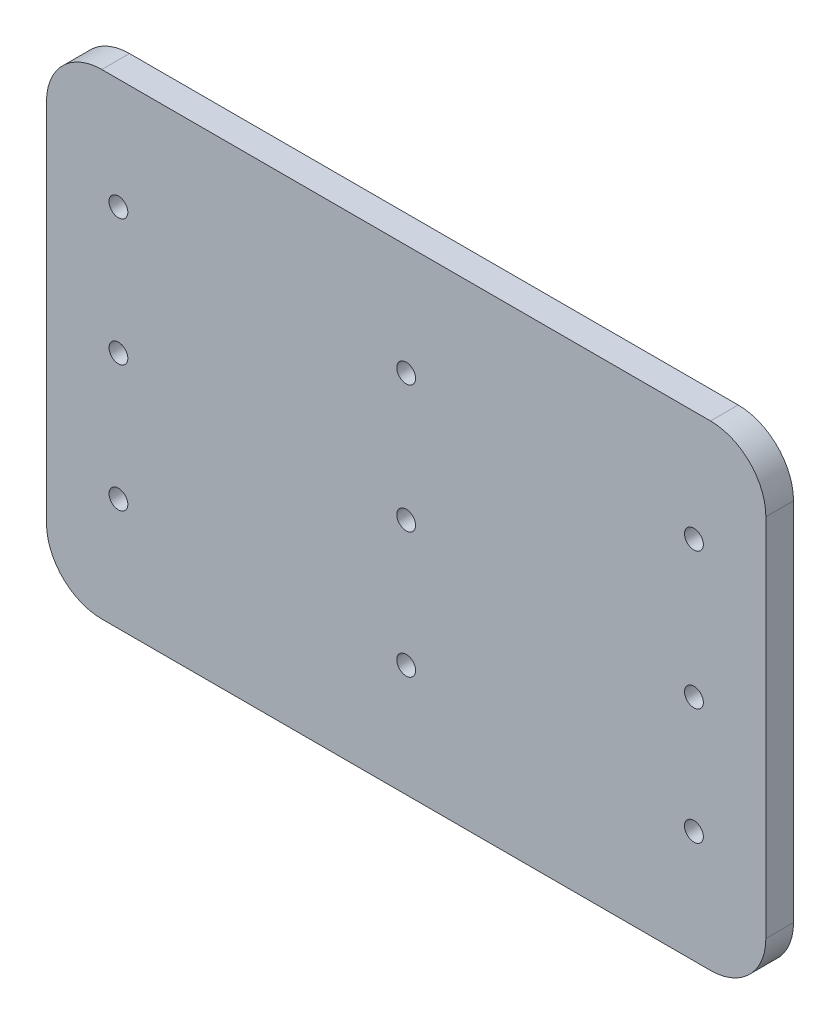
ISO-10303-21;
HEADER;
FILE_DESCRIPTION(('STEP AP214'),'2;1');
FILE_NAME('part.step','',(''),(''),'','','');
FILE_SCHEMA(('AUTOMOTIVE_DESIGN { 1 0 10303 214 1 1 1 1 }'));
ENDSEC;
DATA;
#1=APPLICATION_CONTEXT('core data for automotive mechanical design processes');
#2=APPLICATION_PROTOCOL_DEFINITION('international standard','automotive_design',2000,#1);
#3=PRODUCT_CONTEXT('',#1,'mechanical');
#4=PRODUCT('Part','Part','',(#3));
#5=PRODUCT_RELATED_PRODUCT_CATEGORY('part','',(#4));
#6=PRODUCT_DEFINITION_FORMATION('','',#4);
#7=PRODUCT_DEFINITION_CONTEXT('part definition',#1,'design');
#8=PRODUCT_DEFINITION('design','',#6,#7);
#9=PRODUCT_DEFINITION_SHAPE('','',#8);
#10=(LENGTH_UNIT() NAMED_UNIT(*) SI_UNIT(.MILLI.,.METRE.));
#11=(NAMED_UNIT(*) PLANE_ANGLE_UNIT() SI_UNIT($,.RADIAN.));
#12=(NAMED_UNIT(*) SI_UNIT($,.STERADIAN.) SOLID_ANGLE_UNIT());
#13=UNCERTAINTY_MEASURE_WITH_UNIT(LENGTH_MEASURE(1.E-05),#10,'distance_accuracy_value','');
#14=(GEOMETRIC_REPRESENTATION_CONTEXT(3) GLOBAL_UNCERTAINTY_ASSIGNED_CONTEXT((#13)) GLOBAL_UNIT_ASSIGNED_CONTEXT((#10,
#11,#12)) REPRESENTATION_CONTEXT('',''));
#15=CARTESIAN_POINT('',(0.,0.,0.));
#16=DIRECTION('',(0.,0.,1.));
#17=DIRECTION('',(1.,0.,0.));
#18=AXIS2_PLACEMENT_3D('',#15,#16,#17);
#19=CARTESIAN_POINT('',(-55.,33.,5.));
#20=DIRECTION('',(0.,0.,-1.));
#21=DIRECTION('',(-1.,0.,0.));
#22=AXIS2_PLACEMENT_3D('',#19,#20,#21);
#23=CYLINDRICAL_SURFACE('',#22,9.99999999999999);
#24=CARTESIAN_POINT('',(-55.,33.,0.));
#25=DIRECTION('',(0.,0.,1.));
#26=DIRECTION('',(1.,0.,0.));
#27=AXIS2_PLACEMENT_3D('',#24,#25,#26);
#28=CIRCLE('',#27,9.99999999999999);
#29=CARTESIAN_POINT('',(-65.,32.9999999999999,0.));
#30=VERTEX_POINT('',#29);
#31=CARTESIAN_POINT('',(-54.9999999999999,43.,0.));
#32=VERTEX_POINT('',#31);
#33=EDGE_CURVE('E179',#30,#32,#28,.F.);
#34=ORIENTED_EDGE('',*,*,#33,.F.);
#35=DIRECTION('',(0.,0.,-1.));
#36=VECTOR('',#35,1.);
#37=CARTESIAN_POINT('',(-65.,32.9999999999999,5.));
#38=LINE('',#37,#36);
#39=CARTESIAN_POINT('',(-65.,32.9999999999999,5.));
#40=VERTEX_POINT('',#39);
#41=EDGE_CURVE('E11',#40,#30,#38,.T.);
#42=ORIENTED_EDGE('',*,*,#41,.F.);
#43=CARTESIAN_POINT('',(-55.,33.,5.));
#44=DIRECTION('',(0.,0.,1.));
#45=DIRECTION('',(1.,0.,0.));
#46=AXIS2_PLACEMENT_3D('',#43,#44,#45);
#47=CIRCLE('',#46,9.99999999999999);
#48=CARTESIAN_POINT('',(-54.9999999999999,43.,5.));
#49=VERTEX_POINT('',#48);
#50=EDGE_CURVE('E243',#40,#49,#47,.F.);
#51=ORIENTED_EDGE('',*,*,#50,.T.);
#52=DIRECTION('',(0.,0.,-1.));
#53=VECTOR('',#52,1.);
#54=CARTESIAN_POINT('',(-54.9999999999999,43.,5.));
#55=LINE('',#54,#53);
#56=EDGE_CURVE('E59',#49,#32,#55,.T.);
#57=ORIENTED_EDGE('',*,*,#56,.T.);
#58=EDGE_LOOP('',(#34,#42,#51,#57));
#59=FACE_BOUND('',#58,.T.);
#60=ADVANCED_FACE('F41',(#59),#23,.T.);
#61=CARTESIAN_POINT('',(-65.,0.,5.));
#62=DIRECTION('',(1.,0.,0.));
#63=DIRECTION('',(0.,0.,-1.));
#64=AXIS2_PLACEMENT_3D('',#61,#62,#63);
#65=PLANE('',#64);
#66=DIRECTION('',(0.,-1.,0.));
#67=VECTOR('',#66,1.);
#68=CARTESIAN_POINT('',(-65.,0.,0.));
#69=LINE('',#68,#67);
#70=CARTESIAN_POINT('',(-65.,-32.9999999999999,0.));
#71=VERTEX_POINT('',#70);
#72=EDGE_CURVE('E182',#30,#71,#69,.T.);
#73=ORIENTED_EDGE('',*,*,#72,.T.);
#74=DIRECTION('',(0.,0.,-1.));
#75=VECTOR('',#74,1.);
#76=CARTESIAN_POINT('',(-65.,-32.9999999999999,5.));
#77=LINE('',#76,#75);
#78=CARTESIAN_POINT('',(-65.,-32.9999999999999,5.));
#79=VERTEX_POINT('',#78);
#80=EDGE_CURVE('E51',#79,#71,#77,.T.);
#81=ORIENTED_EDGE('',*,*,#80,.F.);
#82=DIRECTION('',(0.,-1.,0.));
#83=VECTOR('',#82,1.);
#84=CARTESIAN_POINT('',(-65.,0.,5.));
#85=LINE('',#84,#83);
#86=EDGE_CURVE('E239',#40,#79,#85,.T.);
#87=ORIENTED_EDGE('',*,*,#86,.F.);
#88=ORIENTED_EDGE('',*,*,#41,.T.);
#89=EDGE_LOOP('',(#73,#81,#87,#88));
#90=FACE_BOUND('',#89,.T.);
#91=ADVANCED_FACE('F230',(#90),#65,.F.);
#92=CARTESIAN_POINT('',(-55.,-33.,5.));
#93=DIRECTION('',(0.,0.,-1.));
#94=DIRECTION('',(-1.,0.,0.));
#95=AXIS2_PLACEMENT_3D('',#92,#93,#94);
#96=CYLINDRICAL_SURFACE('',#95,10.);
#97=CARTESIAN_POINT('',(-55.,-33.,0.));
#98=DIRECTION('',(0.,0.,1.));
#99=DIRECTION('',(1.,0.,0.));
#100=AXIS2_PLACEMENT_3D('',#97,#98,#99);
#101=CIRCLE('',#100,10.);
#102=CARTESIAN_POINT('',(-54.9999999999999,-43.,0.));
#103=VERTEX_POINT('',#102);
#104=EDGE_CURVE('E186',#103,#71,#101,.F.);
#105=ORIENTED_EDGE('',*,*,#104,.F.);
#106=DIRECTION('',(0.,0.,-1.));
#107=VECTOR('',#106,1.);
#108=CARTESIAN_POINT('',(-54.9999999999999,-43.,5.));
#109=LINE('',#108,#107);
#110=CARTESIAN_POINT('',(-54.9999999999999,-43.,5.));
#111=VERTEX_POINT('',#110);
#112=EDGE_CURVE('E218',#111,#103,#109,.T.);
#113=ORIENTED_EDGE('',*,*,#112,.F.);
#114=CARTESIAN_POINT('',(-55.,-33.,5.));
#115=DIRECTION('',(0.,0.,1.));
#116=DIRECTION('',(1.,0.,0.));
#117=AXIS2_PLACEMENT_3D('',#114,#115,#116);
#118=CIRCLE('',#117,10.);
#119=EDGE_CURVE('E227',#111,#79,#118,.F.);
#120=ORIENTED_EDGE('',*,*,#119,.T.);
#121=ORIENTED_EDGE('',*,*,#80,.T.);
#122=EDGE_LOOP('',(#105,#113,#120,#121));
#123=FACE_BOUND('',#122,.T.);
#124=ADVANCED_FACE('F225',(#123),#96,.T.);
#125=CARTESIAN_POINT('',(0.,-43.,5.));
#126=DIRECTION('',(0.,1.,0.));
#127=DIRECTION('',(0.,0.,1.));
#128=AXIS2_PLACEMENT_3D('',#125,#126,#127);
#129=PLANE('',#128);
#130=DIRECTION('',(1.,0.,0.));
#131=VECTOR('',#130,1.);
#132=CARTESIAN_POINT('',(0.,-43.,0.));
#133=LINE('',#132,#131);
#134=CARTESIAN_POINT('',(54.9999999999999,-43.,0.));
#135=VERTEX_POINT('',#134);
#136=EDGE_CURVE('E190',#103,#135,#133,.T.);
#137=ORIENTED_EDGE('',*,*,#136,.T.);
#138=DIRECTION('',(0.,0.,-1.));
#139=VECTOR('',#138,1.);
#140=CARTESIAN_POINT('',(54.9999999999999,-43.,5.));
#141=LINE('',#140,#139);
#142=CARTESIAN_POINT('',(54.9999999999999,-43.,5.));
#143=VERTEX_POINT('',#142);
#144=EDGE_CURVE('E214',#143,#135,#141,.T.);
#145=ORIENTED_EDGE('',*,*,#144,.F.);
#146=DIRECTION('',(1.,0.,0.));
#147=VECTOR('',#146,1.);
#148=CARTESIAN_POINT('',(0.,-43.,5.));
#149=LINE('',#148,#147);
#150=EDGE_CURVE('E137',#111,#143,#149,.T.);
#151=ORIENTED_EDGE('',*,*,#150,.F.);
#152=ORIENTED_EDGE('',*,*,#112,.T.);
#153=EDGE_LOOP('',(#137,#145,#151,#152));
#154=FACE_BOUND('',#153,.T.);
#155=ADVANCED_FACE('F236',(#154),#129,.F.);
#156=CARTESIAN_POINT('',(55.,-33.,5.));
#157=DIRECTION('',(0.,0.,-1.));
#158=DIRECTION('',(-1.,0.,0.));
#159=AXIS2_PLACEMENT_3D('',#156,#157,#158);
#160=CYLINDRICAL_SURFACE('',#159,9.99999999999999);
#161=CARTESIAN_POINT('',(55.,-33.,0.));
#162=DIRECTION('',(0.,0.,1.));
#163=DIRECTION('',(1.,0.,0.));
#164=AXIS2_PLACEMENT_3D('',#161,#162,#163);
#165=CIRCLE('',#164,9.99999999999999);
#166=CARTESIAN_POINT('',(65.,-32.9999999999999,0.));
#167=VERTEX_POINT('',#166);
#168=EDGE_CURVE('E194',#135,#167,#165,.T.);
#169=ORIENTED_EDGE('',*,*,#168,.T.);
#170=DIRECTION('',(0.,0.,-1.));
#171=VECTOR('',#170,1.);
#172=CARTESIAN_POINT('',(65.,-32.9999999999999,5.));
#173=LINE('',#172,#171);
#174=CARTESIAN_POINT('',(65.,-32.9999999999999,5.));
#175=VERTEX_POINT('',#174);
#176=EDGE_CURVE('E120',#175,#167,#173,.T.);
#177=ORIENTED_EDGE('',*,*,#176,.F.);
#178=CARTESIAN_POINT('',(55.,-33.,5.));
#179=DIRECTION('',(0.,0.,1.));
#180=DIRECTION('',(1.,0.,0.));
#181=AXIS2_PLACEMENT_3D('',#178,#179,#180);
#182=CIRCLE('',#181,9.99999999999999);
#183=EDGE_CURVE('E132',#143,#175,#182,.T.);
#184=ORIENTED_EDGE('',*,*,#183,.F.);
#185=ORIENTED_EDGE('',*,*,#144,.T.);
#186=EDGE_LOOP('',(#169,#177,#184,#185));
#187=FACE_BOUND('',#186,.T.);
#188=ADVANCED_FACE('F386',(#187),#160,.T.);
#189=CARTESIAN_POINT('',(65.,0.,5.));
#190=DIRECTION('',(1.,0.,0.));
#191=DIRECTION('',(0.,0.,-1.));
#192=AXIS2_PLACEMENT_3D('',#189,#190,#191);
#193=PLANE('',#192);
#194=DIRECTION('',(0.,-1.,0.));
#195=VECTOR('',#194,1.);
#196=CARTESIAN_POINT('',(65.,0.,0.));
#197=LINE('',#196,#195);
#198=CARTESIAN_POINT('',(65.,32.9999999999999,0.));
#199=VERTEX_POINT('',#198);
#200=EDGE_CURVE('E116',#199,#167,#197,.T.);
#201=ORIENTED_EDGE('',*,*,#200,.F.);
#202=DIRECTION('',(0.,0.,-1.));
#203=VECTOR('',#202,1.);
#204=CARTESIAN_POINT('',(65.,32.9999999999999,5.));
#205=LINE('',#204,#203);
#206=CARTESIAN_POINT('',(65.,32.9999999999999,5.));
#207=VERTEX_POINT('',#206);
#208=EDGE_CURVE('E110',#207,#199,#205,.T.);
#209=ORIENTED_EDGE('',*,*,#208,.F.);
#210=DIRECTION('',(0.,-1.,0.));
#211=VECTOR('',#210,1.);
#212=CARTESIAN_POINT('',(65.,0.,5.));
#213=LINE('',#212,#211);
#214=EDGE_CURVE('E114',#207,#175,#213,.T.);
#215=ORIENTED_EDGE('',*,*,#214,.T.);
#216=ORIENTED_EDGE('',*,*,#176,.T.);
#217=EDGE_LOOP('',(#201,#209,#215,#216));
#218=FACE_BOUND('',#217,.T.);
#219=ADVANCED_FACE('F112',(#218),#193,.T.);
#220=CARTESIAN_POINT('',(55.,33.,5.));
#221=DIRECTION('',(0.,0.,-1.));
#222=DIRECTION('',(-1.,0.,0.));
#223=AXIS2_PLACEMENT_3D('',#220,#221,#222);
#224=CYLINDRICAL_SURFACE('',#223,10.);
#225=CARTESIAN_POINT('',(55.,33.,0.));
#226=DIRECTION('',(0.,0.,1.));
#227=DIRECTION('',(1.,0.,0.));
#228=AXIS2_PLACEMENT_3D('',#225,#226,#227);
#229=CIRCLE('',#228,10.);
#230=CARTESIAN_POINT('',(54.9999999999999,43.,0.));
#231=VERTEX_POINT('',#230);
#232=EDGE_CURVE('E200',#199,#231,#229,.T.);
#233=ORIENTED_EDGE('',*,*,#232,.T.);
#234=DIRECTION('',(0.,0.,-1.));
#235=VECTOR('',#234,1.);
#236=CARTESIAN_POINT('',(54.9999999999999,43.,5.));
#237=LINE('',#236,#235);
#238=CARTESIAN_POINT('',(54.9999999999999,43.,5.));
#239=VERTEX_POINT('',#238);
#240=EDGE_CURVE('E85',#239,#231,#237,.T.);
#241=ORIENTED_EDGE('',*,*,#240,.F.);
#242=CARTESIAN_POINT('',(55.,33.,5.));
#243=DIRECTION('',(0.,0.,1.));
#244=DIRECTION('',(1.,0.,0.));
#245=AXIS2_PLACEMENT_3D('',#242,#243,#244);
#246=CIRCLE('',#245,10.);
#247=EDGE_CURVE('E122',#207,#239,#246,.T.);
#248=ORIENTED_EDGE('',*,*,#247,.F.);
#249=ORIENTED_EDGE('',*,*,#208,.T.);
#250=EDGE_LOOP('',(#233,#241,#248,#249));
#251=FACE_BOUND('',#250,.T.);
#252=ADVANCED_FACE('F123',(#251),#224,.T.);
#253=CARTESIAN_POINT('',(-52.,-22.72,5.));
#254=DIRECTION('',(0.,0.,-1.));
#255=DIRECTION('',(-1.,0.,0.));
#256=AXIS2_PLACEMENT_3D('',#253,#254,#255);
#257=CYLINDRICAL_SURFACE('',#256,1.7);
#258=CARTESIAN_POINT('',(-52.,-22.72,5.));
#259=DIRECTION('',(0.,0.,1.));
#260=DIRECTION('',(1.,0.,0.));
#261=AXIS2_PLACEMENT_3D('',#258,#259,#260);
#262=CIRCLE('',#261,1.7);
#263=CARTESIAN_POINT('',(-50.3,-22.72,5.));
#264=VERTEX_POINT('',#263);
#265=EDGE_CURVE('E248',#264,#264,#262,.T.);
#266=ORIENTED_EDGE('',*,*,#265,.T.);
#267=EDGE_LOOP('',(#266));
#268=FACE_BOUND('',#267,.T.);
#269=CARTESIAN_POINT('',(-52.,-22.72,0.));
#270=DIRECTION('',(0.,0.,1.));
#271=DIRECTION('',(1.,0.,0.));
#272=AXIS2_PLACEMENT_3D('',#269,#270,#271);
#273=CIRCLE('',#272,1.7);
#274=CARTESIAN_POINT('',(-50.3,-22.72,0.));
#275=VERTEX_POINT('',#274);
#276=EDGE_CURVE('E175',#275,#275,#273,.T.);
#277=ORIENTED_EDGE('',*,*,#276,.F.);
#278=EDGE_LOOP('',(#277));
#279=FACE_BOUND('',#278,.T.);
#280=ADVANCED_FACE('F306',(#268,#279),#257,.F.);
#281=CARTESIAN_POINT('',(52.,23.,5.));
#282=DIRECTION('',(0.,0.,-1.));
#283=DIRECTION('',(-1.,0.,0.));
#284=AXIS2_PLACEMENT_3D('',#281,#282,#283);
#285=CYLINDRICAL_SURFACE('',#284,1.7);
#286=CARTESIAN_POINT('',(52.,23.,5.));
#287=DIRECTION('',(0.,0.,1.));
#288=DIRECTION('',(1.,0.,0.));
#289=AXIS2_PLACEMENT_3D('',#286,#287,#288);
#290=CIRCLE('',#289,1.7);
#291=CARTESIAN_POINT('',(53.7,23.,5.));
#292=VERTEX_POINT('',#291);
#293=EDGE_CURVE('E252',#292,#292,#290,.T.);
#294=ORIENTED_EDGE('',*,*,#293,.T.);
#295=EDGE_LOOP('',(#294));
#296=FACE_BOUND('',#295,.T.);
#297=CARTESIAN_POINT('',(52.,23.,0.));
#298=DIRECTION('',(0.,0.,1.));
#299=DIRECTION('',(1.,0.,0.));
#300=AXIS2_PLACEMENT_3D('',#297,#298,#299);
#301=CIRCLE('',#300,1.7);
#302=CARTESIAN_POINT('',(53.7,23.,0.));
#303=VERTEX_POINT('',#302);
#304=EDGE_CURVE('E171',#303,#303,#301,.T.);
#305=ORIENTED_EDGE('',*,*,#304,.F.);
#306=EDGE_LOOP('',(#305));
#307=FACE_BOUND('',#306,.T.);
#308=ADVANCED_FACE('F309',(#296,#307),#285,.F.);
#309=CARTESIAN_POINT('',(52.,-22.72,5.));
#310=DIRECTION('',(0.,0.,-1.));
#311=DIRECTION('',(-1.,0.,0.));
#312=AXIS2_PLACEMENT_3D('',#309,#310,#311);
#313=CYLINDRICAL_SURFACE('',#312,1.7);
#314=CARTESIAN_POINT('',(52.,-22.72,5.));
#315=DIRECTION('',(0.,0.,1.));
#316=DIRECTION('',(1.,0.,0.));
#317=AXIS2_PLACEMENT_3D('',#314,#315,#316);
#318=CIRCLE('',#317,1.7);
#319=CARTESIAN_POINT('',(53.7,-22.72,5.));
#320=VERTEX_POINT('',#319);
#321=EDGE_CURVE('E256',#320,#320,#318,.T.);
#322=ORIENTED_EDGE('',*,*,#321,.T.);
#323=EDGE_LOOP('',(#322));
#324=FACE_BOUND('',#323,.T.);
#325=CARTESIAN_POINT('',(52.,-22.72,0.));
#326=DIRECTION('',(0.,0.,1.));
#327=DIRECTION('',(1.,0.,0.));
#328=AXIS2_PLACEMENT_3D('',#325,#326,#327);
#329=CIRCLE('',#328,1.7);
#330=CARTESIAN_POINT('',(53.7,-22.72,0.));
#331=VERTEX_POINT('',#330);
#332=EDGE_CURVE('E167',#331,#331,#329,.T.);
#333=ORIENTED_EDGE('',*,*,#332,.F.);
#334=EDGE_LOOP('',(#333));
#335=FACE_BOUND('',#334,.T.);
#336=ADVANCED_FACE('F330',(#324,#335),#313,.F.);
#337=CARTESIAN_POINT('',(-52.,0.140000000000001,5.));
#338=DIRECTION('',(0.,0.,-1.));
#339=DIRECTION('',(-1.,0.,0.));
#340=AXIS2_PLACEMENT_3D('',#337,#338,#339);
#341=CYLINDRICAL_SURFACE('',#340,1.7);
#342=CARTESIAN_POINT('',(-52.,0.140000000000001,5.));
#343=DIRECTION('',(0.,0.,1.));
#344=DIRECTION('',(1.,0.,0.));
#345=AXIS2_PLACEMENT_3D('',#342,#343,#344);
#346=CIRCLE('',#345,1.7);
#347=CARTESIAN_POINT('',(-50.3,0.140000000000001,5.));
#348=VERTEX_POINT('',#347);
#349=EDGE_CURVE('E260',#348,#348,#346,.T.);
#350=ORIENTED_EDGE('',*,*,#349,.T.);
#351=EDGE_LOOP('',(#350));
#352=FACE_BOUND('',#351,.T.);
#353=CARTESIAN_POINT('',(-52.,0.140000000000001,0.));
#354=DIRECTION('',(0.,0.,1.));
#355=DIRECTION('',(1.,0.,0.));
#356=AXIS2_PLACEMENT_3D('',#353,#354,#355);
#357=CIRCLE('',#356,1.7);
#358=CARTESIAN_POINT('',(-50.3,0.140000000000001,0.));
#359=VERTEX_POINT('',#358);
#360=EDGE_CURVE('E163',#359,#359,#357,.T.);
#361=ORIENTED_EDGE('',*,*,#360,.F.);
#362=EDGE_LOOP('',(#361));
#363=FACE_BOUND('',#362,.T.);
#364=ADVANCED_FACE('F334',(#352,#363),#341,.F.);
#365=CARTESIAN_POINT('',(0.,0.,5.));
#366=DIRECTION('',(0.,0.,-1.));
#367=DIRECTION('',(-1.,0.,0.));
#368=AXIS2_PLACEMENT_3D('',#365,#366,#367);
#369=CYLINDRICAL_SURFACE('',#368,1.7);
#370=CARTESIAN_POINT('',(0.,0.,5.));
#371=DIRECTION('',(0.,0.,1.));
#372=DIRECTION('',(1.,0.,0.));
#373=AXIS2_PLACEMENT_3D('',#370,#371,#372);
#374=CIRCLE('',#373,1.7);
#375=CARTESIAN_POINT('',(1.7,0.,5.));
#376=VERTEX_POINT('',#375);
#377=EDGE_CURVE('E264',#376,#376,#374,.T.);
#378=ORIENTED_EDGE('',*,*,#377,.T.);
#379=EDGE_LOOP('',(#378));
#380=FACE_BOUND('',#379,.T.);
#381=CARTESIAN_POINT('',(0.,0.,0.));
#382=DIRECTION('',(0.,0.,1.));
#383=DIRECTION('',(1.,0.,0.));
#384=AXIS2_PLACEMENT_3D('',#381,#382,#383);
#385=CIRCLE('',#384,1.7);
#386=CARTESIAN_POINT('',(1.7,0.,0.));
#387=VERTEX_POINT('',#386);
#388=EDGE_CURVE('E159',#387,#387,#385,.T.);
#389=ORIENTED_EDGE('',*,*,#388,.F.);
#390=EDGE_LOOP('',(#389));
#391=FACE_BOUND('',#390,.T.);
#392=ADVANCED_FACE('F338',(#380,#391),#369,.F.);
#393=CARTESIAN_POINT('',(0.,-22.72,5.));
#394=DIRECTION('',(0.,0.,-1.));
#395=DIRECTION('',(-1.,0.,0.));
#396=AXIS2_PLACEMENT_3D('',#393,#394,#395);
#397=CYLINDRICAL_SURFACE('',#396,1.7);
#398=CARTESIAN_POINT('',(0.,-22.72,5.));
#399=DIRECTION('',(0.,0.,1.));
#400=DIRECTION('',(1.,0.,0.));
#401=AXIS2_PLACEMENT_3D('',#398,#399,#400);
#402=CIRCLE('',#401,1.7);
#403=CARTESIAN_POINT('',(1.7,-22.72,5.));
#404=VERTEX_POINT('',#403);
#405=EDGE_CURVE('E268',#404,#404,#402,.T.);
#406=ORIENTED_EDGE('',*,*,#405,.T.);
#407=EDGE_LOOP('',(#406));
#408=FACE_BOUND('',#407,.T.);
#409=CARTESIAN_POINT('',(0.,-22.72,0.));
#410=DIRECTION('',(0.,0.,1.));
#411=DIRECTION('',(1.,0.,0.));
#412=AXIS2_PLACEMENT_3D('',#409,#410,#411);
#413=CIRCLE('',#412,1.7);
#414=CARTESIAN_POINT('',(1.7,-22.72,0.));
#415=VERTEX_POINT('',#414);
#416=EDGE_CURVE('E155',#415,#415,#413,.T.);
#417=ORIENTED_EDGE('',*,*,#416,.F.);
#418=EDGE_LOOP('',(#417));
#419=FACE_BOUND('',#418,.T.);
#420=ADVANCED_FACE('F342',(#408,#419),#397,.F.);
#421=CARTESIAN_POINT('',(0.,23.,5.));
#422=DIRECTION('',(0.,0.,-1.));
#423=DIRECTION('',(-1.,0.,0.));
#424=AXIS2_PLACEMENT_3D('',#421,#422,#423);
#425=CYLINDRICAL_SURFACE('',#424,1.7);
#426=CARTESIAN_POINT('',(0.,23.,5.));
#427=DIRECTION('',(0.,0.,1.));
#428=DIRECTION('',(1.,0.,0.));
#429=AXIS2_PLACEMENT_3D('',#426,#427,#428);
#430=CIRCLE('',#429,1.7);
#431=CARTESIAN_POINT('',(1.69999999999998,23.,5.));
#432=VERTEX_POINT('',#431);
#433=EDGE_CURVE('E272',#432,#432,#430,.T.);
#434=ORIENTED_EDGE('',*,*,#433,.T.);
#435=EDGE_LOOP('',(#434));
#436=FACE_BOUND('',#435,.T.);
#437=CARTESIAN_POINT('',(0.,23.,0.));
#438=DIRECTION('',(0.,0.,1.));
#439=DIRECTION('',(1.,0.,0.));
#440=AXIS2_PLACEMENT_3D('',#437,#438,#439);
#441=CIRCLE('',#440,1.7);
#442=CARTESIAN_POINT('',(1.69999999999998,23.,0.));
#443=VERTEX_POINT('',#442);
#444=EDGE_CURVE('E151',#443,#443,#441,.T.);
#445=ORIENTED_EDGE('',*,*,#444,.F.);
#446=EDGE_LOOP('',(#445));
#447=FACE_BOUND('',#446,.T.);
#448=ADVANCED_FACE('F346',(#436,#447),#425,.F.);
#449=CARTESIAN_POINT('',(52.,-1.70000000000001,5.));
#450=DIRECTION('',(0.,0.,-1.));
#451=DIRECTION('',(-1.,0.,0.));
#452=AXIS2_PLACEMENT_3D('',#449,#450,#451);
#453=CYLINDRICAL_SURFACE('',#452,1.7);
#454=CARTESIAN_POINT('',(52.,-1.70000000000001,5.));
#455=DIRECTION('',(0.,0.,1.));
#456=DIRECTION('',(1.,0.,0.));
#457=AXIS2_PLACEMENT_3D('',#454,#455,#456);
#458=CIRCLE('',#457,1.7);
#459=CARTESIAN_POINT('',(53.7,-1.70000000000001,5.));
#460=VERTEX_POINT('',#459);
#461=EDGE_CURVE('E276',#460,#460,#458,.T.);
#462=ORIENTED_EDGE('',*,*,#461,.T.);
#463=EDGE_LOOP('',(#462));
#464=FACE_BOUND('',#463,.T.);
#465=CARTESIAN_POINT('',(52.,-1.70000000000001,0.));
#466=DIRECTION('',(0.,0.,1.));
#467=DIRECTION('',(1.,0.,0.));
#468=AXIS2_PLACEMENT_3D('',#465,#466,#467);
#469=CIRCLE('',#468,1.7);
#470=CARTESIAN_POINT('',(53.7,-1.70000000000001,0.));
#471=VERTEX_POINT('',#470);
#472=EDGE_CURVE('E147',#471,#471,#469,.T.);
#473=ORIENTED_EDGE('',*,*,#472,.F.);
#474=EDGE_LOOP('',(#473));
#475=FACE_BOUND('',#474,.T.);
#476=ADVANCED_FACE('F349',(#464,#475),#453,.F.);
#477=CARTESIAN_POINT('',(-52.,23.,5.));
#478=DIRECTION('',(0.,0.,-1.));
#479=DIRECTION('',(-1.,0.,0.));
#480=AXIS2_PLACEMENT_3D('',#477,#478,#479);
#481=CYLINDRICAL_SURFACE('',#480,1.7);
#482=CARTESIAN_POINT('',(-52.,23.,5.));
#483=DIRECTION('',(0.,0.,1.));
#484=DIRECTION('',(1.,0.,0.));
#485=AXIS2_PLACEMENT_3D('',#482,#483,#484);
#486=CIRCLE('',#485,1.7);
#487=CARTESIAN_POINT('',(-50.3,23.,5.));
#488=VERTEX_POINT('',#487);
#489=EDGE_CURVE('E207',#488,#488,#486,.T.);
#490=ORIENTED_EDGE('',*,*,#489,.T.);
#491=EDGE_LOOP('',(#490));
#492=FACE_BOUND('',#491,.T.);
#493=CARTESIAN_POINT('',(-52.,23.,0.));
#494=DIRECTION('',(0.,0.,1.));
#495=DIRECTION('',(1.,0.,0.));
#496=AXIS2_PLACEMENT_3D('',#493,#494,#495);
#497=CIRCLE('',#496,1.7);
#498=CARTESIAN_POINT('',(-50.3,23.,0.));
#499=VERTEX_POINT('',#498);
#500=EDGE_CURVE('E143',#499,#499,#497,.T.);
#501=ORIENTED_EDGE('',*,*,#500,.F.);
#502=EDGE_LOOP('',(#501));
#503=FACE_BOUND('',#502,.T.);
#504=ADVANCED_FACE('F43',(#492,#503),#481,.F.);
#505=CARTESIAN_POINT('',(0.,43.,5.));
#506=DIRECTION('',(0.,1.,0.));
#507=DIRECTION('',(0.,0.,1.));
#508=AXIS2_PLACEMENT_3D('',#505,#506,#507);
#509=PLANE('',#508);
#510=DIRECTION('',(1.,0.,0.));
#511=VECTOR('',#510,1.);
#512=CARTESIAN_POINT('',(0.,43.,0.));
#513=LINE('',#512,#511);
#514=EDGE_CURVE('E203',#32,#231,#513,.T.);
#515=ORIENTED_EDGE('',*,*,#514,.F.);
#516=ORIENTED_EDGE('',*,*,#56,.F.);
#517=DIRECTION('',(1.,0.,0.));
#518=VECTOR('',#517,1.);
#519=CARTESIAN_POINT('',(0.,43.,5.));
#520=LINE('',#519,#518);
#521=EDGE_CURVE('E127',#49,#239,#520,.T.);
#522=ORIENTED_EDGE('',*,*,#521,.T.);
#523=ORIENTED_EDGE('',*,*,#240,.T.);
#524=EDGE_LOOP('',(#515,#516,#522,#523));
#525=FACE_BOUND('',#524,.T.);
#526=ADVANCED_FACE('F288',(#525),#509,.T.);
#527=CARTESIAN_POINT('',(0.,0.,5.));
#528=DIRECTION('',(0.,0.,1.));
#529=DIRECTION('',(1.,0.,0.));
#530=AXIS2_PLACEMENT_3D('',#527,#528,#529);
#531=PLANE('',#530);
#532=ORIENTED_EDGE('',*,*,#489,.F.);
#533=EDGE_LOOP('',(#532));
#534=FACE_BOUND('',#533,.T.);
#535=ORIENTED_EDGE('',*,*,#461,.F.);
#536=EDGE_LOOP('',(#535));
#537=FACE_BOUND('',#536,.T.);
#538=ORIENTED_EDGE('',*,*,#433,.F.);
#539=EDGE_LOOP('',(#538));
#540=FACE_BOUND('',#539,.T.);
#541=ORIENTED_EDGE('',*,*,#405,.F.);
#542=EDGE_LOOP('',(#541));
#543=FACE_BOUND('',#542,.T.);
#544=ORIENTED_EDGE('',*,*,#377,.F.);
#545=EDGE_LOOP('',(#544));
#546=FACE_BOUND('',#545,.T.);
#547=ORIENTED_EDGE('',*,*,#349,.F.);
#548=EDGE_LOOP('',(#547));
#549=FACE_BOUND('',#548,.T.);
#550=ORIENTED_EDGE('',*,*,#321,.F.);
#551=EDGE_LOOP('',(#550));
#552=FACE_BOUND('',#551,.T.);
#553=ORIENTED_EDGE('',*,*,#293,.F.);
#554=EDGE_LOOP('',(#553));
#555=FACE_BOUND('',#554,.T.);
#556=ORIENTED_EDGE('',*,*,#265,.F.);
#557=EDGE_LOOP('',(#556));
#558=FACE_BOUND('',#557,.T.);
#559=ORIENTED_EDGE('',*,*,#50,.F.);
#560=ORIENTED_EDGE('',*,*,#86,.T.);
#561=ORIENTED_EDGE('',*,*,#119,.F.);
#562=ORIENTED_EDGE('',*,*,#150,.T.);
#563=ORIENTED_EDGE('',*,*,#183,.T.);
#564=ORIENTED_EDGE('',*,*,#214,.F.);
#565=ORIENTED_EDGE('',*,*,#247,.T.);
#566=ORIENTED_EDGE('',*,*,#521,.F.);
#567=EDGE_LOOP('',(#559,#560,#561,#562,#563,#564,#565,#566));
#568=FACE_BOUND('',#567,.T.);
#569=ADVANCED_FACE('F130',(#534,#537,#540,#543,#546,#549,#552,#555,#558,#568),#531,.T.);
#570=CARTESIAN_POINT('',(0.,0.,0.));
#571=DIRECTION('',(0.,0.,1.));
#572=DIRECTION('',(1.,0.,0.));
#573=AXIS2_PLACEMENT_3D('',#570,#571,#572);
#574=PLANE('',#573);
#575=ORIENTED_EDGE('',*,*,#500,.T.);
#576=EDGE_LOOP('',(#575));
#577=FACE_BOUND('',#576,.T.);
#578=ORIENTED_EDGE('',*,*,#472,.T.);
#579=EDGE_LOOP('',(#578));
#580=FACE_BOUND('',#579,.T.);
#581=ORIENTED_EDGE('',*,*,#444,.T.);
#582=EDGE_LOOP('',(#581));
#583=FACE_BOUND('',#582,.T.);
#584=ORIENTED_EDGE('',*,*,#416,.T.);
#585=EDGE_LOOP('',(#584));
#586=FACE_BOUND('',#585,.T.);
#587=ORIENTED_EDGE('',*,*,#388,.T.);
#588=EDGE_LOOP('',(#587));
#589=FACE_BOUND('',#588,.T.);
#590=ORIENTED_EDGE('',*,*,#360,.T.);
#591=EDGE_LOOP('',(#590));
#592=FACE_BOUND('',#591,.T.);
#593=ORIENTED_EDGE('',*,*,#332,.T.);
#594=EDGE_LOOP('',(#593));
#595=FACE_BOUND('',#594,.T.);
#596=ORIENTED_EDGE('',*,*,#304,.T.);
#597=EDGE_LOOP('',(#596));
#598=FACE_BOUND('',#597,.T.);
#599=ORIENTED_EDGE('',*,*,#276,.T.);
#600=EDGE_LOOP('',(#599));
#601=FACE_BOUND('',#600,.T.);
#602=ORIENTED_EDGE('',*,*,#33,.T.);
#603=ORIENTED_EDGE('',*,*,#514,.T.);
#604=ORIENTED_EDGE('',*,*,#232,.F.);
#605=ORIENTED_EDGE('',*,*,#200,.T.);
#606=ORIENTED_EDGE('',*,*,#168,.F.);
#607=ORIENTED_EDGE('',*,*,#136,.F.);
#608=ORIENTED_EDGE('',*,*,#104,.T.);
#609=ORIENTED_EDGE('',*,*,#72,.F.);
#610=EDGE_LOOP('',(#602,#603,#604,#605,#606,#607,#608,#609));
#611=FACE_BOUND('',#610,.T.);
#612=ADVANCED_FACE('F233',(#577,#580,#583,#586,#589,#592,#595,#598,#601,#611),#574,.F.);
#613=CLOSED_SHELL('',(#60,#91,#124,#155,#188,#219,#252,#280,#308,#336,#364,#392,#420,#448,#476,
#504,#526,#569,#612));
#614=MANIFOLD_SOLID_BREP('B2',#613);
#615=ADVANCED_BREP_SHAPE_REPRESENTATION('',(#18,#614),#14);
#616=SHAPE_DEFINITION_REPRESENTATION(#9,#615);
ENDSEC;
END-ISO-10303-21;
